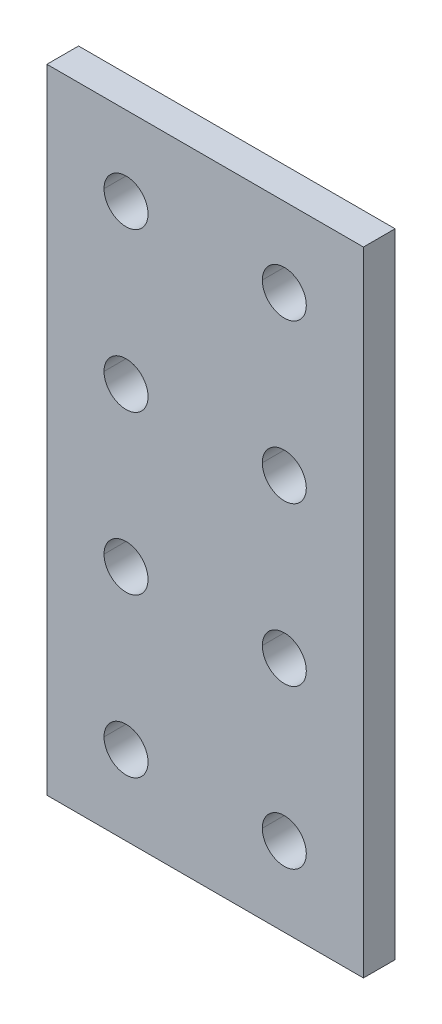
ISO-10303-21;
HEADER;
FILE_DESCRIPTION(('STEP AP214'),'2;1');
FILE_NAME('part.step','',(''),(''),'','','');
FILE_SCHEMA(('AUTOMOTIVE_DESIGN { 1 0 10303 214 1 1 1 1 }'));
ENDSEC;
DATA;
#1=APPLICATION_CONTEXT('core data for automotive mechanical design processes');
#2=APPLICATION_PROTOCOL_DEFINITION('international standard','automotive_design',2000,#1);
#3=PRODUCT_CONTEXT('',#1,'mechanical');
#4=PRODUCT('Part','Part','',(#3));
#5=PRODUCT_RELATED_PRODUCT_CATEGORY('part','',(#4));
#6=PRODUCT_DEFINITION_FORMATION('','',#4);
#7=PRODUCT_DEFINITION_CONTEXT('part definition',#1,'design');
#8=PRODUCT_DEFINITION('design','',#6,#7);
#9=PRODUCT_DEFINITION_SHAPE('','',#8);
#10=(LENGTH_UNIT() NAMED_UNIT(*) SI_UNIT(.MILLI.,.METRE.));
#11=(NAMED_UNIT(*) PLANE_ANGLE_UNIT() SI_UNIT($,.RADIAN.));
#12=(NAMED_UNIT(*) SI_UNIT($,.STERADIAN.) SOLID_ANGLE_UNIT());
#13=UNCERTAINTY_MEASURE_WITH_UNIT(LENGTH_MEASURE(1.E-05),#10,'distance_accuracy_value','');
#14=(GEOMETRIC_REPRESENTATION_CONTEXT(3) GLOBAL_UNCERTAINTY_ASSIGNED_CONTEXT((#13)) GLOBAL_UNIT_ASSIGNED_CONTEXT((#10,
#11,#12)) REPRESENTATION_CONTEXT('',''));
#15=CARTESIAN_POINT('',(0.,0.,0.));
#16=DIRECTION('',(0.,0.,1.));
#17=DIRECTION('',(1.,0.,0.));
#18=AXIS2_PLACEMENT_3D('',#15,#16,#17);
#19=CARTESIAN_POINT('',(20.,80.,4.));
#20=DIRECTION('',(0.,-1.,0.));
#21=DIRECTION('',(0.,0.,-1.));
#22=AXIS2_PLACEMENT_3D('',#19,#20,#21);
#23=PLANE('',#22);
#24=DIRECTION('',(-1.,0.,0.));
#25=VECTOR('',#24,1.);
#26=CARTESIAN_POINT('',(20.,80.,0.));
#27=LINE('',#26,#25);
#28=CARTESIAN_POINT('',(20.,80.,0.));
#29=VERTEX_POINT('',#28);
#30=CARTESIAN_POINT('',(-20.,80.,0.));
#31=VERTEX_POINT('',#30);
#32=EDGE_CURVE('E12',#29,#31,#27,.T.);
#33=ORIENTED_EDGE('',*,*,#32,.T.);
#34=DIRECTION('',(0.,0.,-1.));
#35=VECTOR('',#34,1.);
#36=CARTESIAN_POINT('',(-20.,80.,4.));
#37=LINE('',#36,#35);
#38=CARTESIAN_POINT('',(-20.,80.,4.));
#39=VERTEX_POINT('',#38);
#40=EDGE_CURVE('E29',#39,#31,#37,.T.);
#41=ORIENTED_EDGE('',*,*,#40,.F.);
#42=DIRECTION('',(-1.,0.,0.));
#43=VECTOR('',#42,1.);
#44=CARTESIAN_POINT('',(20.,80.,4.));
#45=LINE('',#44,#43);
#46=CARTESIAN_POINT('',(20.,80.,4.));
#47=VERTEX_POINT('',#46);
#48=EDGE_CURVE('E580',#47,#39,#45,.T.);
#49=ORIENTED_EDGE('',*,*,#48,.F.);
#50=DIRECTION('',(0.,0.,-1.));
#51=VECTOR('',#50,1.);
#52=CARTESIAN_POINT('',(20.,80.,4.));
#53=LINE('',#52,#51);
#54=EDGE_CURVE('E583',#47,#29,#53,.T.);
#55=ORIENTED_EDGE('',*,*,#54,.T.);
#56=EDGE_LOOP('',(#33,#41,#49,#55));
#57=FACE_BOUND('',#56,.T.);
#58=ADVANCED_FACE('F20',(#57),#23,.F.);
#59=CARTESIAN_POINT('',(20.,0.,4.));
#60=DIRECTION('',(-1.,0.,0.));
#61=DIRECTION('',(0.,0.,1.));
#62=AXIS2_PLACEMENT_3D('',#59,#60,#61);
#63=PLANE('',#62);
#64=DIRECTION('',(0.,1.,0.));
#65=VECTOR('',#64,1.);
#66=CARTESIAN_POINT('',(20.,0.,0.));
#67=LINE('',#66,#65);
#68=CARTESIAN_POINT('',(20.,0.,0.));
#69=VERTEX_POINT('',#68);
#70=EDGE_CURVE('E567',#69,#29,#67,.T.);
#71=ORIENTED_EDGE('',*,*,#70,.T.);
#72=ORIENTED_EDGE('',*,*,#54,.F.);
#73=DIRECTION('',(0.,1.,0.));
#74=VECTOR('',#73,1.);
#75=CARTESIAN_POINT('',(20.,0.,4.));
#76=LINE('',#75,#74);
#77=CARTESIAN_POINT('',(20.,0.,4.));
#78=VERTEX_POINT('',#77);
#79=EDGE_CURVE('E636',#78,#47,#76,.T.);
#80=ORIENTED_EDGE('',*,*,#79,.F.);
#81=DIRECTION('',(0.,0.,-1.));
#82=VECTOR('',#81,1.);
#83=CARTESIAN_POINT('',(20.,0.,4.));
#84=LINE('',#83,#82);
#85=EDGE_CURVE('E619',#78,#69,#84,.T.);
#86=ORIENTED_EDGE('',*,*,#85,.T.);
#87=EDGE_LOOP('',(#71,#72,#80,#86));
#88=FACE_BOUND('',#87,.T.);
#89=ADVANCED_FACE('F462',(#88),#63,.F.);
#90=CARTESIAN_POINT('',(-20.,0.,4.));
#91=DIRECTION('',(0.,1.,0.));
#92=DIRECTION('',(0.,0.,1.));
#93=AXIS2_PLACEMENT_3D('',#90,#91,#92);
#94=PLANE('',#93);
#95=DIRECTION('',(1.,0.,0.));
#96=VECTOR('',#95,1.);
#97=CARTESIAN_POINT('',(-20.,0.,0.));
#98=LINE('',#97,#96);
#99=CARTESIAN_POINT('',(-20.,0.,0.));
#100=VERTEX_POINT('',#99);
#101=EDGE_CURVE('E571',#100,#69,#98,.T.);
#102=ORIENTED_EDGE('',*,*,#101,.T.);
#103=ORIENTED_EDGE('',*,*,#85,.F.);
#104=DIRECTION('',(1.,0.,0.));
#105=VECTOR('',#104,1.);
#106=CARTESIAN_POINT('',(-20.,0.,4.));
#107=LINE('',#106,#105);
#108=CARTESIAN_POINT('',(-20.,0.,4.));
#109=VERTEX_POINT('',#108);
#110=EDGE_CURVE('E609',#109,#78,#107,.T.);
#111=ORIENTED_EDGE('',*,*,#110,.F.);
#112=DIRECTION('',(0.,0.,-1.));
#113=VECTOR('',#112,1.);
#114=CARTESIAN_POINT('',(-20.,0.,4.));
#115=LINE('',#114,#113);
#116=EDGE_CURVE('E574',#109,#100,#115,.T.);
#117=ORIENTED_EDGE('',*,*,#116,.T.);
#118=EDGE_LOOP('',(#102,#103,#111,#117));
#119=FACE_BOUND('',#118,.T.);
#120=ADVANCED_FACE('F465',(#119),#94,.F.);
#121=CARTESIAN_POINT('',(-20.,80.,4.));
#122=DIRECTION('',(1.,0.,0.));
#123=DIRECTION('',(0.,0.,-1.));
#124=AXIS2_PLACEMENT_3D('',#121,#122,#123);
#125=PLANE('',#124);
#126=DIRECTION('',(0.,-1.,0.));
#127=VECTOR('',#126,1.);
#128=CARTESIAN_POINT('',(-20.,80.,0.));
#129=LINE('',#128,#127);
#130=EDGE_CURVE('E569',#31,#100,#129,.T.);
#131=ORIENTED_EDGE('',*,*,#130,.T.);
#132=ORIENTED_EDGE('',*,*,#116,.F.);
#133=DIRECTION('',(0.,-1.,0.));
#134=VECTOR('',#133,1.);
#135=CARTESIAN_POINT('',(-20.,80.,4.));
#136=LINE('',#135,#134);
#137=EDGE_CURVE('E575',#39,#109,#136,.T.);
#138=ORIENTED_EDGE('',*,*,#137,.F.);
#139=ORIENTED_EDGE('',*,*,#40,.T.);
#140=EDGE_LOOP('',(#131,#132,#138,#139));
#141=FACE_BOUND('',#140,.T.);
#142=ADVANCED_FACE('F469',(#141),#125,.F.);
#143=CARTESIAN_POINT('',(0.,0.,4.));
#144=DIRECTION('',(0.,0.,1.));
#145=DIRECTION('',(1.,0.,0.));
#146=AXIS2_PLACEMENT_3D('',#143,#144,#145);
#147=PLANE('',#146);
#148=CARTESIAN_POINT('',(-10.,70.,4.));
#149=DIRECTION('',(0.,0.,1.));
#150=DIRECTION('',(1.,0.,0.));
#151=AXIS2_PLACEMENT_3D('',#148,#149,#150);
#152=CIRCLE('',#151,2.78);
#153=CARTESIAN_POINT('',(-12.78,70.,4.));
#154=VERTEX_POINT('',#153);
#155=CARTESIAN_POINT('',(-7.22,70.,4.));
#156=VERTEX_POINT('',#155);
#157=EDGE_CURVE('E482',#154,#156,#152,.T.);
#158=ORIENTED_EDGE('',*,*,#157,.F.);
#159=CARTESIAN_POINT('',(-10.,70.,4.));
#160=DIRECTION('',(0.,0.,1.));
#161=DIRECTION('',(1.,0.,0.));
#162=AXIS2_PLACEMENT_3D('',#159,#160,#161);
#163=CIRCLE('',#162,2.78);
#164=EDGE_CURVE('E531',#156,#154,#163,.T.);
#165=ORIENTED_EDGE('',*,*,#164,.F.);
#166=EDGE_LOOP('',(#158,#165));
#167=FACE_BOUND('',#166,.T.);
#168=CARTESIAN_POINT('',(-10.,50.,4.));
#169=DIRECTION('',(0.,0.,1.));
#170=DIRECTION('',(1.,0.,0.));
#171=AXIS2_PLACEMENT_3D('',#168,#169,#170);
#172=CIRCLE('',#171,2.78);
#173=CARTESIAN_POINT('',(-12.78,50.,4.));
#174=VERTEX_POINT('',#173);
#175=CARTESIAN_POINT('',(-7.22,50.,4.));
#176=VERTEX_POINT('',#175);
#177=EDGE_CURVE('E307',#174,#176,#172,.T.);
#178=ORIENTED_EDGE('',*,*,#177,.F.);
#179=CARTESIAN_POINT('',(-10.,50.,4.));
#180=DIRECTION('',(0.,0.,1.));
#181=DIRECTION('',(1.,0.,0.));
#182=AXIS2_PLACEMENT_3D('',#179,#180,#181);
#183=CIRCLE('',#182,2.78);
#184=EDGE_CURVE('E302',#176,#174,#183,.T.);
#185=ORIENTED_EDGE('',*,*,#184,.F.);
#186=EDGE_LOOP('',(#178,#185));
#187=FACE_BOUND('',#186,.T.);
#188=CARTESIAN_POINT('',(-10.,30.,4.));
#189=DIRECTION('',(0.,0.,1.));
#190=DIRECTION('',(1.,0.,0.));
#191=AXIS2_PLACEMENT_3D('',#188,#189,#190);
#192=CIRCLE('',#191,2.78);
#193=CARTESIAN_POINT('',(-12.78,30.,4.));
#194=VERTEX_POINT('',#193);
#195=CARTESIAN_POINT('',(-7.22,30.,4.));
#196=VERTEX_POINT('',#195);
#197=EDGE_CURVE('E301',#194,#196,#192,.T.);
#198=ORIENTED_EDGE('',*,*,#197,.F.);
#199=CARTESIAN_POINT('',(-10.,30.,4.));
#200=DIRECTION('',(0.,0.,1.));
#201=DIRECTION('',(1.,0.,0.));
#202=AXIS2_PLACEMENT_3D('',#199,#200,#201);
#203=CIRCLE('',#202,2.78);
#204=EDGE_CURVE('E650',#196,#194,#203,.T.);
#205=ORIENTED_EDGE('',*,*,#204,.F.);
#206=EDGE_LOOP('',(#198,#205));
#207=FACE_BOUND('',#206,.T.);
#208=CARTESIAN_POINT('',(-10.,10.,4.));
#209=DIRECTION('',(0.,0.,1.));
#210=DIRECTION('',(1.,0.,0.));
#211=AXIS2_PLACEMENT_3D('',#208,#209,#210);
#212=CIRCLE('',#211,2.78);
#213=CARTESIAN_POINT('',(-12.78,10.,4.));
#214=VERTEX_POINT('',#213);
#215=CARTESIAN_POINT('',(-7.22,10.,4.));
#216=VERTEX_POINT('',#215);
#217=EDGE_CURVE('E492',#214,#216,#212,.T.);
#218=ORIENTED_EDGE('',*,*,#217,.F.);
#219=CARTESIAN_POINT('',(-10.,10.,4.));
#220=DIRECTION('',(0.,0.,1.));
#221=DIRECTION('',(1.,0.,0.));
#222=AXIS2_PLACEMENT_3D('',#219,#220,#221);
#223=CIRCLE('',#222,2.78);
#224=EDGE_CURVE('E500',#216,#214,#223,.T.);
#225=ORIENTED_EDGE('',*,*,#224,.F.);
#226=EDGE_LOOP('',(#218,#225));
#227=FACE_BOUND('',#226,.T.);
#228=CARTESIAN_POINT('',(10.,70.,4.));
#229=DIRECTION('',(0.,0.,1.));
#230=DIRECTION('',(1.,0.,0.));
#231=AXIS2_PLACEMENT_3D('',#228,#229,#230);
#232=CIRCLE('',#231,2.78);
#233=CARTESIAN_POINT('',(7.22,70.,4.));
#234=VERTEX_POINT('',#233);
#235=CARTESIAN_POINT('',(12.78,70.,4.));
#236=VERTEX_POINT('',#235);
#237=EDGE_CURVE('E229',#234,#236,#232,.T.);
#238=ORIENTED_EDGE('',*,*,#237,.F.);
#239=CARTESIAN_POINT('',(10.,70.,4.));
#240=DIRECTION('',(0.,0.,1.));
#241=DIRECTION('',(1.,0.,0.));
#242=AXIS2_PLACEMENT_3D('',#239,#240,#241);
#243=CIRCLE('',#242,2.78);
#244=EDGE_CURVE('E224',#236,#234,#243,.T.);
#245=ORIENTED_EDGE('',*,*,#244,.F.);
#246=EDGE_LOOP('',(#238,#245));
#247=FACE_BOUND('',#246,.T.);
#248=CARTESIAN_POINT('',(10.,50.,4.));
#249=DIRECTION('',(0.,0.,1.));
#250=DIRECTION('',(1.,0.,0.));
#251=AXIS2_PLACEMENT_3D('',#248,#249,#250);
#252=CIRCLE('',#251,2.78);
#253=CARTESIAN_POINT('',(7.22,50.,4.));
#254=VERTEX_POINT('',#253);
#255=CARTESIAN_POINT('',(12.78,50.,4.));
#256=VERTEX_POINT('',#255);
#257=EDGE_CURVE('E223',#254,#256,#252,.T.);
#258=ORIENTED_EDGE('',*,*,#257,.F.);
#259=CARTESIAN_POINT('',(10.,50.,4.));
#260=DIRECTION('',(0.,0.,1.));
#261=DIRECTION('',(1.,0.,0.));
#262=AXIS2_PLACEMENT_3D('',#259,#260,#261);
#263=CIRCLE('',#262,2.78);
#264=EDGE_CURVE('E422',#256,#254,#263,.T.);
#265=ORIENTED_EDGE('',*,*,#264,.F.);
#266=EDGE_LOOP('',(#258,#265));
#267=FACE_BOUND('',#266,.T.);
#268=CARTESIAN_POINT('',(10.,30.,4.));
#269=DIRECTION('',(0.,0.,1.));
#270=DIRECTION('',(1.,0.,0.));
#271=AXIS2_PLACEMENT_3D('',#268,#269,#270);
#272=CIRCLE('',#271,2.78);
#273=CARTESIAN_POINT('',(7.22,30.,4.));
#274=VERTEX_POINT('',#273);
#275=CARTESIAN_POINT('',(12.78,30.,4.));
#276=VERTEX_POINT('',#275);
#277=EDGE_CURVE('E176',#274,#276,#272,.T.);
#278=ORIENTED_EDGE('',*,*,#277,.F.);
#279=CARTESIAN_POINT('',(10.,30.,4.));
#280=DIRECTION('',(0.,0.,1.));
#281=DIRECTION('',(1.,0.,0.));
#282=AXIS2_PLACEMENT_3D('',#279,#280,#281);
#283=CIRCLE('',#282,2.78);
#284=EDGE_CURVE('E412',#276,#274,#283,.T.);
#285=ORIENTED_EDGE('',*,*,#284,.F.);
#286=EDGE_LOOP('',(#278,#285));
#287=FACE_BOUND('',#286,.T.);
#288=CARTESIAN_POINT('',(10.,10.,4.));
#289=DIRECTION('',(0.,0.,1.));
#290=DIRECTION('',(1.,0.,0.));
#291=AXIS2_PLACEMENT_3D('',#288,#289,#290);
#292=CIRCLE('',#291,2.78);
#293=CARTESIAN_POINT('',(7.22,10.,4.));
#294=VERTEX_POINT('',#293);
#295=CARTESIAN_POINT('',(12.78,10.,4.));
#296=VERTEX_POINT('',#295);
#297=EDGE_CURVE('E408',#294,#296,#292,.T.);
#298=ORIENTED_EDGE('',*,*,#297,.F.);
#299=CARTESIAN_POINT('',(10.,10.,4.));
#300=DIRECTION('',(0.,0.,1.));
#301=DIRECTION('',(1.,0.,0.));
#302=AXIS2_PLACEMENT_3D('',#299,#300,#301);
#303=CIRCLE('',#302,2.78);
#304=EDGE_CURVE('E407',#296,#294,#303,.T.);
#305=ORIENTED_EDGE('',*,*,#304,.F.);
#306=EDGE_LOOP('',(#298,#305));
#307=FACE_BOUND('',#306,.T.);
#308=ORIENTED_EDGE('',*,*,#48,.T.);
#309=ORIENTED_EDGE('',*,*,#137,.T.);
#310=ORIENTED_EDGE('',*,*,#110,.T.);
#311=ORIENTED_EDGE('',*,*,#79,.T.);
#312=EDGE_LOOP('',(#308,#309,#310,#311));
#313=FACE_BOUND('',#312,.T.);
#314=ADVANCED_FACE('F440',(#167,#187,#207,#227,#247,#267,#287,#307,#313),#147,.T.);
#315=CARTESIAN_POINT('',(10.,10.,4.));
#316=DIRECTION('',(0.,0.,-1.));
#317=DIRECTION('',(0.,-1.,0.));
#318=AXIS2_PLACEMENT_3D('',#315,#316,#317);
#319=CYLINDRICAL_SURFACE('',#318,2.78);
#320=DIRECTION('',(0.,0.,-1.));
#321=VECTOR('',#320,1.);
#322=CARTESIAN_POINT('',(12.78,10.,4.));
#323=LINE('',#322,#321);
#324=CARTESIAN_POINT('',(12.78,10.,0.));
#325=VERTEX_POINT('',#324);
#326=EDGE_CURVE('E542',#296,#325,#323,.T.);
#327=ORIENTED_EDGE('',*,*,#326,.F.);
#328=ORIENTED_EDGE('',*,*,#304,.T.);
#329=DIRECTION('',(0.,0.,-1.));
#330=VECTOR('',#329,1.);
#331=CARTESIAN_POINT('',(7.22,10.,4.));
#332=LINE('',#331,#330);
#333=CARTESIAN_POINT('',(7.22,10.,0.));
#334=VERTEX_POINT('',#333);
#335=EDGE_CURVE('E539',#294,#334,#332,.T.);
#336=ORIENTED_EDGE('',*,*,#335,.T.);
#337=CARTESIAN_POINT('',(10.,10.,0.));
#338=DIRECTION('',(0.,0.,1.));
#339=DIRECTION('',(1.,0.,0.));
#340=AXIS2_PLACEMENT_3D('',#337,#338,#339);
#341=CIRCLE('',#340,2.78);
#342=EDGE_CURVE('E536',#325,#334,#341,.T.);
#343=ORIENTED_EDGE('',*,*,#342,.F.);
#344=EDGE_LOOP('',(#327,#328,#336,#343));
#345=FACE_BOUND('',#344,.T.);
#346=ADVANCED_FACE('F449',(#345),#319,.F.);
#347=CARTESIAN_POINT('',(0.,0.,0.));
#348=DIRECTION('',(0.,0.,1.));
#349=DIRECTION('',(1.,0.,0.));
#350=AXIS2_PLACEMENT_3D('',#347,#348,#349);
#351=PLANE('',#350);
#352=CARTESIAN_POINT('',(-10.,70.,0.));
#353=DIRECTION('',(0.,0.,1.));
#354=DIRECTION('',(1.,0.,0.));
#355=AXIS2_PLACEMENT_3D('',#352,#353,#354);
#356=CIRCLE('',#355,2.78);
#357=CARTESIAN_POINT('',(-7.22,70.,0.));
#358=VERTEX_POINT('',#357);
#359=CARTESIAN_POINT('',(-12.78,70.,0.));
#360=VERTEX_POINT('',#359);
#361=EDGE_CURVE('E325',#358,#360,#356,.T.);
#362=ORIENTED_EDGE('',*,*,#361,.T.);
#363=CARTESIAN_POINT('',(-10.,70.,0.));
#364=DIRECTION('',(0.,0.,1.));
#365=DIRECTION('',(1.,0.,0.));
#366=AXIS2_PLACEMENT_3D('',#363,#364,#365);
#367=CIRCLE('',#366,2.78);
#368=EDGE_CURVE('E321',#360,#358,#367,.T.);
#369=ORIENTED_EDGE('',*,*,#368,.T.);
#370=EDGE_LOOP('',(#362,#369));
#371=FACE_BOUND('',#370,.T.);
#372=CARTESIAN_POINT('',(-10.,50.,0.));
#373=DIRECTION('',(0.,0.,1.));
#374=DIRECTION('',(1.,0.,0.));
#375=AXIS2_PLACEMENT_3D('',#372,#373,#374);
#376=CIRCLE('',#375,2.78);
#377=CARTESIAN_POINT('',(-7.22,50.,0.));
#378=VERTEX_POINT('',#377);
#379=CARTESIAN_POINT('',(-12.78,50.,0.));
#380=VERTEX_POINT('',#379);
#381=EDGE_CURVE('E319',#378,#380,#376,.T.);
#382=ORIENTED_EDGE('',*,*,#381,.T.);
#383=CARTESIAN_POINT('',(-10.,50.,0.));
#384=DIRECTION('',(0.,0.,1.));
#385=DIRECTION('',(1.,0.,0.));
#386=AXIS2_PLACEMENT_3D('',#383,#384,#385);
#387=CIRCLE('',#386,2.78);
#388=EDGE_CURVE('E358',#380,#378,#387,.T.);
#389=ORIENTED_EDGE('',*,*,#388,.T.);
#390=EDGE_LOOP('',(#382,#389));
#391=FACE_BOUND('',#390,.T.);
#392=CARTESIAN_POINT('',(-10.,30.,0.));
#393=DIRECTION('',(0.,0.,1.));
#394=DIRECTION('',(1.,0.,0.));
#395=AXIS2_PLACEMENT_3D('',#392,#393,#394);
#396=CIRCLE('',#395,2.78);
#397=CARTESIAN_POINT('',(-7.22,30.,0.));
#398=VERTEX_POINT('',#397);
#399=CARTESIAN_POINT('',(-12.78,30.,0.));
#400=VERTEX_POINT('',#399);
#401=EDGE_CURVE('E361',#398,#400,#396,.T.);
#402=ORIENTED_EDGE('',*,*,#401,.T.);
#403=CARTESIAN_POINT('',(-10.,30.,0.));
#404=DIRECTION('',(0.,0.,1.));
#405=DIRECTION('',(1.,0.,0.));
#406=AXIS2_PLACEMENT_3D('',#403,#404,#405);
#407=CIRCLE('',#406,2.78);
#408=EDGE_CURVE('E366',#400,#398,#407,.T.);
#409=ORIENTED_EDGE('',*,*,#408,.T.);
#410=EDGE_LOOP('',(#402,#409));
#411=FACE_BOUND('',#410,.T.);
#412=CARTESIAN_POINT('',(-10.,10.,0.));
#413=DIRECTION('',(0.,0.,1.));
#414=DIRECTION('',(1.,0.,0.));
#415=AXIS2_PLACEMENT_3D('',#412,#413,#414);
#416=CIRCLE('',#415,2.78);
#417=CARTESIAN_POINT('',(-7.22,10.,0.));
#418=VERTEX_POINT('',#417);
#419=CARTESIAN_POINT('',(-12.78,10.,0.));
#420=VERTEX_POINT('',#419);
#421=EDGE_CURVE('E247',#418,#420,#416,.T.);
#422=ORIENTED_EDGE('',*,*,#421,.T.);
#423=CARTESIAN_POINT('',(-10.,10.,0.));
#424=DIRECTION('',(0.,0.,1.));
#425=DIRECTION('',(1.,0.,0.));
#426=AXIS2_PLACEMENT_3D('',#423,#424,#425);
#427=CIRCLE('',#426,2.78);
#428=EDGE_CURVE('E243',#420,#418,#427,.T.);
#429=ORIENTED_EDGE('',*,*,#428,.T.);
#430=EDGE_LOOP('',(#422,#429));
#431=FACE_BOUND('',#430,.T.);
#432=CARTESIAN_POINT('',(10.,70.,0.));
#433=DIRECTION('',(0.,0.,1.));
#434=DIRECTION('',(1.,0.,0.));
#435=AXIS2_PLACEMENT_3D('',#432,#433,#434);
#436=CIRCLE('',#435,2.78);
#437=CARTESIAN_POINT('',(12.78,70.,0.));
#438=VERTEX_POINT('',#437);
#439=CARTESIAN_POINT('',(7.22,70.,0.));
#440=VERTEX_POINT('',#439);
#441=EDGE_CURVE('E241',#438,#440,#436,.T.);
#442=ORIENTED_EDGE('',*,*,#441,.T.);
#443=CARTESIAN_POINT('',(10.,70.,0.));
#444=DIRECTION('',(0.,0.,1.));
#445=DIRECTION('',(1.,0.,0.));
#446=AXIS2_PLACEMENT_3D('',#443,#444,#445);
#447=CIRCLE('',#446,2.78);
#448=EDGE_CURVE('E378',#440,#438,#447,.T.);
#449=ORIENTED_EDGE('',*,*,#448,.T.);
#450=EDGE_LOOP('',(#442,#449));
#451=FACE_BOUND('',#450,.T.);
#452=CARTESIAN_POINT('',(10.,50.,0.));
#453=DIRECTION('',(0.,0.,1.));
#454=DIRECTION('',(1.,0.,0.));
#455=AXIS2_PLACEMENT_3D('',#452,#453,#454);
#456=CIRCLE('',#455,2.78);
#457=CARTESIAN_POINT('',(12.78,50.,0.));
#458=VERTEX_POINT('',#457);
#459=CARTESIAN_POINT('',(7.22,50.,0.));
#460=VERTEX_POINT('',#459);
#461=EDGE_CURVE('E382',#458,#460,#456,.T.);
#462=ORIENTED_EDGE('',*,*,#461,.T.);
#463=CARTESIAN_POINT('',(10.,50.,0.));
#464=DIRECTION('',(0.,0.,1.));
#465=DIRECTION('',(1.,0.,0.));
#466=AXIS2_PLACEMENT_3D('',#463,#464,#465);
#467=CIRCLE('',#466,2.78);
#468=EDGE_CURVE('E173',#460,#458,#467,.T.);
#469=ORIENTED_EDGE('',*,*,#468,.T.);
#470=EDGE_LOOP('',(#462,#469));
#471=FACE_BOUND('',#470,.T.);
#472=CARTESIAN_POINT('',(10.,30.,0.));
#473=DIRECTION('',(0.,0.,1.));
#474=DIRECTION('',(1.,0.,0.));
#475=AXIS2_PLACEMENT_3D('',#472,#473,#474);
#476=CIRCLE('',#475,2.78);
#477=CARTESIAN_POINT('',(12.78,30.,0.));
#478=VERTEX_POINT('',#477);
#479=CARTESIAN_POINT('',(7.22,30.,0.));
#480=VERTEX_POINT('',#479);
#481=EDGE_CURVE('E157',#478,#480,#476,.T.);
#482=ORIENTED_EDGE('',*,*,#481,.T.);
#483=CARTESIAN_POINT('',(10.,30.,0.));
#484=DIRECTION('',(0.,0.,1.));
#485=DIRECTION('',(1.,0.,0.));
#486=AXIS2_PLACEMENT_3D('',#483,#484,#485);
#487=CIRCLE('',#486,2.78);
#488=EDGE_CURVE('E153',#480,#478,#487,.T.);
#489=ORIENTED_EDGE('',*,*,#488,.T.);
#490=EDGE_LOOP('',(#482,#489));
#491=FACE_BOUND('',#490,.T.);
#492=ORIENTED_EDGE('',*,*,#342,.T.);
#493=CARTESIAN_POINT('',(10.,10.,0.));
#494=DIRECTION('',(0.,0.,1.));
#495=DIRECTION('',(1.,0.,0.));
#496=AXIS2_PLACEMENT_3D('',#493,#494,#495);
#497=CIRCLE('',#496,2.78);
#498=EDGE_CURVE('E163',#334,#325,#497,.T.);
#499=ORIENTED_EDGE('',*,*,#498,.T.);
#500=EDGE_LOOP('',(#492,#499));
#501=FACE_BOUND('',#500,.T.);
#502=ORIENTED_EDGE('',*,*,#32,.F.);
#503=ORIENTED_EDGE('',*,*,#70,.F.);
#504=ORIENTED_EDGE('',*,*,#101,.F.);
#505=ORIENTED_EDGE('',*,*,#130,.F.);
#506=EDGE_LOOP('',(#502,#503,#504,#505));
#507=FACE_BOUND('',#506,.T.);
#508=ADVANCED_FACE('F155',(#371,#391,#411,#431,#451,#471,#491,#501,#507),#351,.F.);
#509=CARTESIAN_POINT('',(10.,10.,4.));
#510=DIRECTION('',(0.,0.,-1.));
#511=DIRECTION('',(0.,1.,0.));
#512=AXIS2_PLACEMENT_3D('',#509,#510,#511);
#513=CYLINDRICAL_SURFACE('',#512,2.78);
#514=ORIENTED_EDGE('',*,*,#326,.T.);
#515=ORIENTED_EDGE('',*,*,#498,.F.);
#516=ORIENTED_EDGE('',*,*,#335,.F.);
#517=ORIENTED_EDGE('',*,*,#297,.T.);
#518=EDGE_LOOP('',(#514,#515,#516,#517));
#519=FACE_BOUND('',#518,.T.);
#520=ADVANCED_FACE('F448',(#519),#513,.F.);
#521=CARTESIAN_POINT('',(10.,30.,4.));
#522=DIRECTION('',(0.,0.,-1.));
#523=DIRECTION('',(0.,1.,0.));
#524=AXIS2_PLACEMENT_3D('',#521,#522,#523);
#525=CYLINDRICAL_SURFACE('',#524,2.78);
#526=DIRECTION('',(0.,0.,-1.));
#527=VECTOR('',#526,1.);
#528=CARTESIAN_POINT('',(12.78,30.,4.));
#529=LINE('',#528,#527);
#530=EDGE_CURVE('E169',#276,#478,#529,.T.);
#531=ORIENTED_EDGE('',*,*,#530,.T.);
#532=ORIENTED_EDGE('',*,*,#488,.F.);
#533=DIRECTION('',(0.,0.,-1.));
#534=VECTOR('',#533,1.);
#535=CARTESIAN_POINT('',(7.22,30.,4.));
#536=LINE('',#535,#534);
#537=EDGE_CURVE('E171',#274,#480,#536,.T.);
#538=ORIENTED_EDGE('',*,*,#537,.F.);
#539=ORIENTED_EDGE('',*,*,#277,.T.);
#540=EDGE_LOOP('',(#531,#532,#538,#539));
#541=FACE_BOUND('',#540,.T.);
#542=ADVANCED_FACE('F175',(#541),#525,.F.);
#543=CARTESIAN_POINT('',(10.,30.,4.));
#544=DIRECTION('',(0.,0.,-1.));
#545=DIRECTION('',(0.,-1.,0.));
#546=AXIS2_PLACEMENT_3D('',#543,#544,#545);
#547=CYLINDRICAL_SURFACE('',#546,2.78);
#548=ORIENTED_EDGE('',*,*,#530,.F.);
#549=ORIENTED_EDGE('',*,*,#284,.T.);
#550=ORIENTED_EDGE('',*,*,#537,.T.);
#551=ORIENTED_EDGE('',*,*,#481,.F.);
#552=EDGE_LOOP('',(#548,#549,#550,#551));
#553=FACE_BOUND('',#552,.T.);
#554=ADVANCED_FACE('F167',(#553),#547,.F.);
#555=CARTESIAN_POINT('',(10.,50.,4.));
#556=DIRECTION('',(0.,0.,-1.));
#557=DIRECTION('',(0.,1.,0.));
#558=AXIS2_PLACEMENT_3D('',#555,#556,#557);
#559=CYLINDRICAL_SURFACE('',#558,2.78);
#560=DIRECTION('',(0.,0.,-1.));
#561=VECTOR('',#560,1.);
#562=CARTESIAN_POINT('',(12.78,50.,4.));
#563=LINE('',#562,#561);
#564=EDGE_CURVE('E184',#256,#458,#563,.T.);
#565=ORIENTED_EDGE('',*,*,#564,.T.);
#566=ORIENTED_EDGE('',*,*,#468,.F.);
#567=DIRECTION('',(0.,0.,-1.));
#568=VECTOR('',#567,1.);
#569=CARTESIAN_POINT('',(7.22,50.,4.));
#570=LINE('',#569,#568);
#571=EDGE_CURVE('E207',#254,#460,#570,.T.);
#572=ORIENTED_EDGE('',*,*,#571,.F.);
#573=ORIENTED_EDGE('',*,*,#257,.T.);
#574=EDGE_LOOP('',(#565,#566,#572,#573));
#575=FACE_BOUND('',#574,.T.);
#576=ADVANCED_FACE('F437',(#575),#559,.F.);
#577=CARTESIAN_POINT('',(10.,50.,4.));
#578=DIRECTION('',(0.,0.,-1.));
#579=DIRECTION('',(0.,-1.,0.));
#580=AXIS2_PLACEMENT_3D('',#577,#578,#579);
#581=CYLINDRICAL_SURFACE('',#580,2.78);
#582=ORIENTED_EDGE('',*,*,#564,.F.);
#583=ORIENTED_EDGE('',*,*,#264,.T.);
#584=ORIENTED_EDGE('',*,*,#571,.T.);
#585=ORIENTED_EDGE('',*,*,#461,.F.);
#586=EDGE_LOOP('',(#582,#583,#584,#585));
#587=FACE_BOUND('',#586,.T.);
#588=ADVANCED_FACE('F443',(#587),#581,.F.);
#589=CARTESIAN_POINT('',(10.,70.,4.));
#590=DIRECTION('',(0.,0.,-1.));
#591=DIRECTION('',(0.,1.,0.));
#592=AXIS2_PLACEMENT_3D('',#589,#590,#591);
#593=CYLINDRICAL_SURFACE('',#592,2.78);
#594=DIRECTION('',(0.,0.,-1.));
#595=VECTOR('',#594,1.);
#596=CARTESIAN_POINT('',(12.78,70.,4.));
#597=LINE('',#596,#595);
#598=EDGE_CURVE('E507',#236,#438,#597,.T.);
#599=ORIENTED_EDGE('',*,*,#598,.T.);
#600=ORIENTED_EDGE('',*,*,#448,.F.);
#601=DIRECTION('',(0.,0.,-1.));
#602=VECTOR('',#601,1.);
#603=CARTESIAN_POINT('',(7.22,70.,4.));
#604=LINE('',#603,#602);
#605=EDGE_CURVE('E271',#234,#440,#604,.T.);
#606=ORIENTED_EDGE('',*,*,#605,.F.);
#607=ORIENTED_EDGE('',*,*,#237,.T.);
#608=EDGE_LOOP('',(#599,#600,#606,#607));
#609=FACE_BOUND('',#608,.T.);
#610=ADVANCED_FACE('F503',(#609),#593,.F.);
#611=CARTESIAN_POINT('',(10.,70.,4.));
#612=DIRECTION('',(0.,0.,-1.));
#613=DIRECTION('',(0.,-1.,0.));
#614=AXIS2_PLACEMENT_3D('',#611,#612,#613);
#615=CYLINDRICAL_SURFACE('',#614,2.78);
#616=ORIENTED_EDGE('',*,*,#598,.F.);
#617=ORIENTED_EDGE('',*,*,#244,.T.);
#618=ORIENTED_EDGE('',*,*,#605,.T.);
#619=ORIENTED_EDGE('',*,*,#441,.F.);
#620=EDGE_LOOP('',(#616,#617,#618,#619));
#621=FACE_BOUND('',#620,.T.);
#622=ADVANCED_FACE('F508',(#621),#615,.F.);
#623=CARTESIAN_POINT('',(-10.,10.,4.));
#624=DIRECTION('',(0.,0.,-1.));
#625=DIRECTION('',(0.,1.,0.));
#626=AXIS2_PLACEMENT_3D('',#623,#624,#625);
#627=CYLINDRICAL_SURFACE('',#626,2.78);
#628=DIRECTION('',(0.,0.,-1.));
#629=VECTOR('',#628,1.);
#630=CARTESIAN_POINT('',(-7.22,10.,4.));
#631=LINE('',#630,#629);
#632=EDGE_CURVE('E266',#216,#418,#631,.T.);
#633=ORIENTED_EDGE('',*,*,#632,.T.);
#634=ORIENTED_EDGE('',*,*,#428,.F.);
#635=DIRECTION('',(0.,0.,-1.));
#636=VECTOR('',#635,1.);
#637=CARTESIAN_POINT('',(-12.78,10.,4.));
#638=LINE('',#637,#636);
#639=EDGE_CURVE('E264',#214,#420,#638,.T.);
#640=ORIENTED_EDGE('',*,*,#639,.F.);
#641=ORIENTED_EDGE('',*,*,#217,.T.);
#642=EDGE_LOOP('',(#633,#634,#640,#641));
#643=FACE_BOUND('',#642,.T.);
#644=ADVANCED_FACE('F672',(#643),#627,.F.);
#645=CARTESIAN_POINT('',(-10.,10.,4.));
#646=DIRECTION('',(0.,0.,-1.));
#647=DIRECTION('',(0.,-1.,0.));
#648=AXIS2_PLACEMENT_3D('',#645,#646,#647);
#649=CYLINDRICAL_SURFACE('',#648,2.78);
#650=ORIENTED_EDGE('',*,*,#632,.F.);
#651=ORIENTED_EDGE('',*,*,#224,.T.);
#652=ORIENTED_EDGE('',*,*,#639,.T.);
#653=ORIENTED_EDGE('',*,*,#421,.F.);
#654=EDGE_LOOP('',(#650,#651,#652,#653));
#655=FACE_BOUND('',#654,.T.);
#656=ADVANCED_FACE('F668',(#655),#649,.F.);
#657=CARTESIAN_POINT('',(-10.,30.,4.));
#658=DIRECTION('',(0.,0.,-1.));
#659=DIRECTION('',(0.,1.,0.));
#660=AXIS2_PLACEMENT_3D('',#657,#658,#659);
#661=CYLINDRICAL_SURFACE('',#660,2.78);
#662=DIRECTION('',(0.,0.,-1.));
#663=VECTOR('',#662,1.);
#664=CARTESIAN_POINT('',(-7.22,30.,4.));
#665=LINE('',#664,#663);
#666=EDGE_CURVE('E282',#196,#398,#665,.T.);
#667=ORIENTED_EDGE('',*,*,#666,.T.);
#668=ORIENTED_EDGE('',*,*,#408,.F.);
#669=DIRECTION('',(0.,0.,-1.));
#670=VECTOR('',#669,1.);
#671=CARTESIAN_POINT('',(-12.78,30.,4.));
#672=LINE('',#671,#670);
#673=EDGE_CURVE('E287',#194,#400,#672,.T.);
#674=ORIENTED_EDGE('',*,*,#673,.F.);
#675=ORIENTED_EDGE('',*,*,#197,.T.);
#676=EDGE_LOOP('',(#667,#668,#674,#675));
#677=FACE_BOUND('',#676,.T.);
#678=ADVANCED_FACE('F698',(#677),#661,.F.);
#679=CARTESIAN_POINT('',(-10.,30.,4.));
#680=DIRECTION('',(0.,0.,-1.));
#681=DIRECTION('',(0.,-1.,0.));
#682=AXIS2_PLACEMENT_3D('',#679,#680,#681);
#683=CYLINDRICAL_SURFACE('',#682,2.78);
#684=ORIENTED_EDGE('',*,*,#666,.F.);
#685=ORIENTED_EDGE('',*,*,#204,.T.);
#686=ORIENTED_EDGE('',*,*,#673,.T.);
#687=ORIENTED_EDGE('',*,*,#401,.F.);
#688=EDGE_LOOP('',(#684,#685,#686,#687));
#689=FACE_BOUND('',#688,.T.);
#690=ADVANCED_FACE('F692',(#689),#683,.F.);
#691=CARTESIAN_POINT('',(-10.,50.,4.));
#692=DIRECTION('',(0.,0.,-1.));
#693=DIRECTION('',(0.,1.,0.));
#694=AXIS2_PLACEMENT_3D('',#691,#692,#693);
#695=CYLINDRICAL_SURFACE('',#694,2.78);
#696=DIRECTION('',(0.,0.,-1.));
#697=VECTOR('',#696,1.);
#698=CARTESIAN_POINT('',(-7.22,50.,4.));
#699=LINE('',#698,#697);
#700=EDGE_CURVE('E352',#176,#378,#699,.T.);
#701=ORIENTED_EDGE('',*,*,#700,.T.);
#702=ORIENTED_EDGE('',*,*,#388,.F.);
#703=DIRECTION('',(0.,0.,-1.));
#704=VECTOR('',#703,1.);
#705=CARTESIAN_POINT('',(-12.78,50.,4.));
#706=LINE('',#705,#704);
#707=EDGE_CURVE('E345',#174,#380,#706,.T.);
#708=ORIENTED_EDGE('',*,*,#707,.F.);
#709=ORIENTED_EDGE('',*,*,#177,.T.);
#710=EDGE_LOOP('',(#701,#702,#708,#709));
#711=FACE_BOUND('',#710,.T.);
#712=ADVANCED_FACE('F684',(#711),#695,.F.);
#713=CARTESIAN_POINT('',(-10.,50.,4.));
#714=DIRECTION('',(0.,0.,-1.));
#715=DIRECTION('',(0.,-1.,0.));
#716=AXIS2_PLACEMENT_3D('',#713,#714,#715);
#717=CYLINDRICAL_SURFACE('',#716,2.78);
#718=ORIENTED_EDGE('',*,*,#700,.F.);
#719=ORIENTED_EDGE('',*,*,#184,.T.);
#720=ORIENTED_EDGE('',*,*,#707,.T.);
#721=ORIENTED_EDGE('',*,*,#381,.F.);
#722=EDGE_LOOP('',(#718,#719,#720,#721));
#723=FACE_BOUND('',#722,.T.);
#724=ADVANCED_FACE('F685',(#723),#717,.F.);
#725=CARTESIAN_POINT('',(-10.,70.,4.));
#726=DIRECTION('',(0.,0.,-1.));
#727=DIRECTION('',(0.,1.,0.));
#728=AXIS2_PLACEMENT_3D('',#725,#726,#727);
#729=CYLINDRICAL_SURFACE('',#728,2.78);
#730=DIRECTION('',(0.,0.,-1.));
#731=VECTOR('',#730,1.);
#732=CARTESIAN_POINT('',(-7.22,70.,4.));
#733=LINE('',#732,#731);
#734=EDGE_CURVE('E341',#156,#358,#733,.T.);
#735=ORIENTED_EDGE('',*,*,#734,.T.);
#736=ORIENTED_EDGE('',*,*,#368,.F.);
#737=DIRECTION('',(0.,0.,-1.));
#738=VECTOR('',#737,1.);
#739=CARTESIAN_POINT('',(-12.78,70.,4.));
#740=LINE('',#739,#738);
#741=EDGE_CURVE('E340',#154,#360,#740,.T.);
#742=ORIENTED_EDGE('',*,*,#741,.F.);
#743=ORIENTED_EDGE('',*,*,#157,.T.);
#744=EDGE_LOOP('',(#735,#736,#742,#743));
#745=FACE_BOUND('',#744,.T.);
#746=ADVANCED_FACE('F534',(#745),#729,.F.);
#747=CARTESIAN_POINT('',(-10.,70.,4.));
#748=DIRECTION('',(0.,0.,-1.));
#749=DIRECTION('',(0.,-1.,0.));
#750=AXIS2_PLACEMENT_3D('',#747,#748,#749);
#751=CYLINDRICAL_SURFACE('',#750,2.78);
#752=ORIENTED_EDGE('',*,*,#734,.F.);
#753=ORIENTED_EDGE('',*,*,#164,.T.);
#754=ORIENTED_EDGE('',*,*,#741,.T.);
#755=ORIENTED_EDGE('',*,*,#361,.F.);
#756=EDGE_LOOP('',(#752,#753,#754,#755));
#757=FACE_BOUND('',#756,.T.);
#758=ADVANCED_FACE('F530',(#757),#751,.F.);
#759=CLOSED_SHELL('',(#58,#89,#120,#142,#314,#346,#508,#520,#542,#554,#576,#588,#610,#622,#644,
#656,#678,#690,#712,#724,#746,#758));
#760=MANIFOLD_SOLID_BREP('B1',#759);
#761=ADVANCED_BREP_SHAPE_REPRESENTATION('',(#18,#760),#14);
#762=SHAPE_DEFINITION_REPRESENTATION(#9,#761);
ENDSEC;
END-ISO-10303-21;
